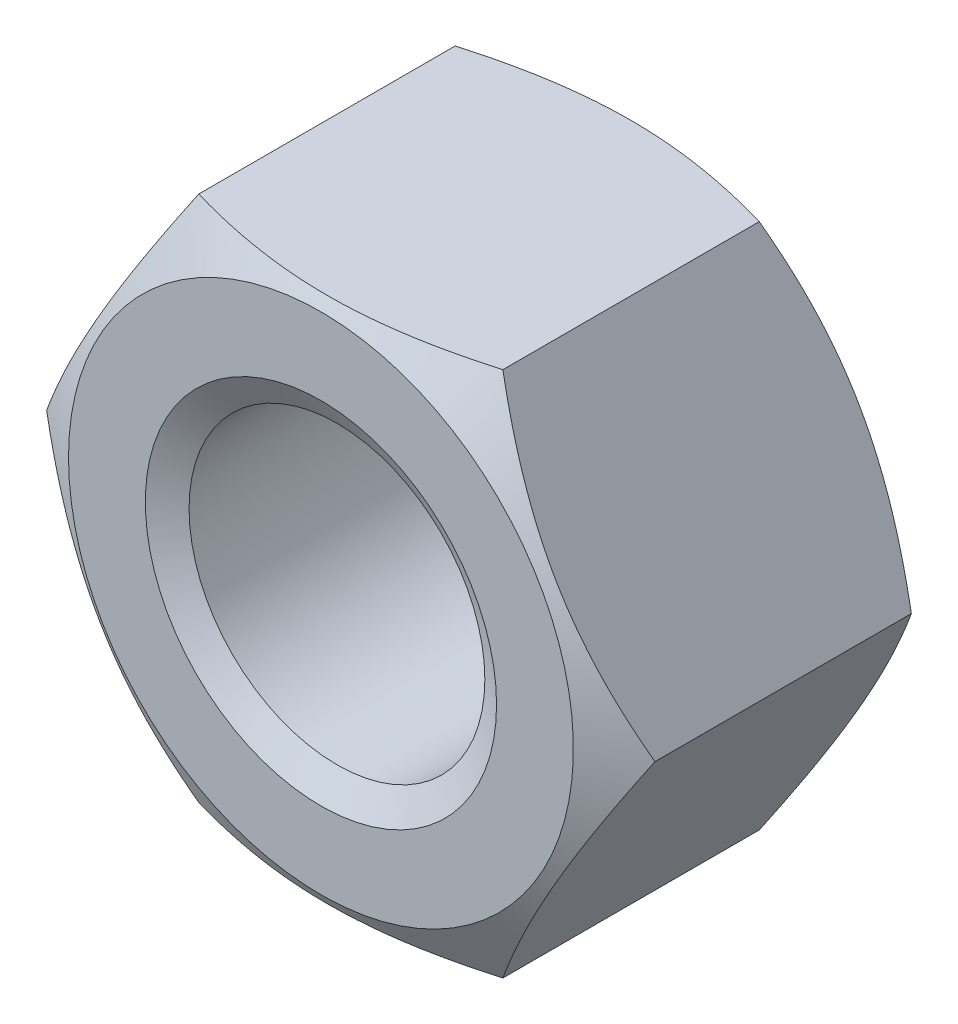
ISO-10303-21;
HEADER;
FILE_DESCRIPTION(('STEP AP214'),'2;1');
FILE_NAME('part.step','',(''),(''),'','','');
FILE_SCHEMA(('AUTOMOTIVE_DESIGN { 1 0 10303 214 1 1 1 1 }'));
ENDSEC;
DATA;
#1=APPLICATION_CONTEXT('core data for automotive mechanical design processes');
#2=APPLICATION_PROTOCOL_DEFINITION('international standard','automotive_design',2000,#1);
#3=PRODUCT_CONTEXT('',#1,'mechanical');
#4=PRODUCT('Part','Part','',(#3));
#5=PRODUCT_RELATED_PRODUCT_CATEGORY('part','',(#4));
#6=PRODUCT_DEFINITION_FORMATION('','',#4);
#7=PRODUCT_DEFINITION_CONTEXT('part definition',#1,'design');
#8=PRODUCT_DEFINITION('design','',#6,#7);
#9=PRODUCT_DEFINITION_SHAPE('','',#8);
#10=(LENGTH_UNIT() NAMED_UNIT(*) SI_UNIT(.MILLI.,.METRE.));
#11=(NAMED_UNIT(*) PLANE_ANGLE_UNIT() SI_UNIT($,.RADIAN.));
#12=(NAMED_UNIT(*) SI_UNIT($,.STERADIAN.) SOLID_ANGLE_UNIT());
#13=UNCERTAINTY_MEASURE_WITH_UNIT(LENGTH_MEASURE(1.E-05),#10,'distance_accuracy_value','');
#14=(GEOMETRIC_REPRESENTATION_CONTEXT(3) GLOBAL_UNCERTAINTY_ASSIGNED_CONTEXT((#13)) GLOBAL_UNIT_ASSIGNED_CONTEXT((#10,
#11,#12)) REPRESENTATION_CONTEXT('',''));
#15=CARTESIAN_POINT('',(0.,0.,0.));
#16=DIRECTION('',(0.,0.,1.));
#17=DIRECTION('',(1.,0.,0.));
#18=AXIS2_PLACEMENT_3D('',#15,#16,#17);
#19=CARTESIAN_POINT('',(5.19615242270663,-9.,-10.8));
#20=DIRECTION('',(0.866025403784439,-0.5,0.));
#21=DIRECTION('',(0.5,0.866025403784439,0.));
#22=AXIS2_PLACEMENT_3D('',#19,#20,#21);
#23=PLANE('',#22);
#24=CARTESIAN_POINT('',(5.19603695265279,-9.0002,-1.02042059601723));
#25=CARTESIAN_POINT('',(5.31024090414014,-8.80239295359878,-0.954488352820151));
#26=CARTESIAN_POINT('',(5.42489028935503,-8.60381439335005,-0.891547760156409));
#27=CARTESIAN_POINT('',(5.65512011728599,-8.20504463395579,-0.772475348601635));
#28=CARTESIAN_POINT('',(5.77070093910682,-8.00485277818155,-0.716346468698161));
#29=CARTESIAN_POINT('',(6.00300811711762,-7.6024849429039,-0.611658311675062));
#30=CARTESIAN_POINT('',(6.11973652630804,-7.4003054074994,-0.563117123858886));
#31=CARTESIAN_POINT('',(6.35398725476077,-6.99457124410925,-0.474654867734021));
#32=CARTESIAN_POINT('',(6.47150940676616,-6.79101690582109,-0.434732038429374));
#33=CARTESIAN_POINT('',(6.70436794207328,-6.38769409169309,-0.365191025093216));
#34=CARTESIAN_POINT('',(6.81968712510143,-6.187955407601,-0.335343853793902));
#35=CARTESIAN_POINT('',(7.05084147798785,-5.787584324011,-0.285299660805185));
#36=CARTESIAN_POINT('',(7.16667660134328,-5.58695200505839,-0.265101786483643));
#37=CARTESIAN_POINT('',(7.39854776775318,-5.18533936402618,-0.23486069834345));
#38=CARTESIAN_POINT('',(7.51458343241836,-4.98435969733606,-0.224805960530406));
#39=CARTESIAN_POINT('',(7.74676155069016,-4.58221540008358,-0.215068686091186));
#40=CARTESIAN_POINT('',(7.86290400088661,-4.38105077542778,-0.215385829010859));
#41=CARTESIAN_POINT('',(8.08003584616207,-4.0049673874695,-0.225670303099276));
#42=CARTESIAN_POINT('',(8.18104055171996,-3.83002210563971,-0.234383090976499));
#43=CARTESIAN_POINT('',(8.38281337570171,-3.48054132291665,-0.259483691011472));
#44=CARTESIAN_POINT('',(8.4835814777175,-3.30600585044303,-0.275872020526772));
#45=CARTESIAN_POINT('',(8.78549567413909,-2.7830751227145,-0.336162907181933));
#46=CARTESIAN_POINT('',(8.98610736306935,-2.43560548489508,-0.391183833287231));
#47=CARTESIAN_POINT('',(9.38945876049729,-1.736980371246,-0.528736827271252));
#48=CARTESIAN_POINT('',(9.59214699192736,-1.38591405631283,-0.611851969573208));
#49=CARTESIAN_POINT('',(9.99450087051226,-0.689016695981394,-0.800488890382561));
#50=CARTESIAN_POINT('',(10.1941716700214,-0.34317672644372,-0.905966363839456));
#51=CARTESIAN_POINT('',(10.3924203154671,0.000200000000002153,-1.02042059601723));
#52=B_SPLINE_CURVE_WITH_KNOTS('',3,(#24,#25,#26,#27,#28,#29,#30,#31,#32,#33,#34,#35,#36,#37,#38,
#39,#40,#41,#42,#43,#44,#45,#46,#47,#48,#49,#50,#51),.UNSPECIFIED.,.F.,.F.,(4,2,2,2,2,2,2,2,2,2,
2,2,2,4),(0.,0.713219249102577,1.42674513853509,2.14194697262263,2.8570025303448,
3.55449749123034,4.25193080859214,4.94857085059645,5.64518936892662,6.25162976378283,
6.8581110406634,8.07193747617894,9.31268391793541,10.5509947443908),.UNSPECIFIED.);
#53=CARTESIAN_POINT('',(5.19615242270663,-9.,-1.02035392823946));
#54=VERTEX_POINT('',#53);
#55=CARTESIAN_POINT('',(10.3923048454133,0.,-1.02035392823947));
#56=VERTEX_POINT('',#55);
#57=EDGE_CURVE('E51',#54,#56,#52,.T.);
#58=ORIENTED_EDGE('',*,*,#57,.F.);
#59=DIRECTION('',(0.,0.,1.));
#60=VECTOR('',#59,1.);
#61=CARTESIAN_POINT('',(5.19615242270663,-9.,-10.8));
#62=LINE('',#61,#60);
#63=CARTESIAN_POINT('',(5.19615242270663,-9.,-9.77964607176054));
#64=VERTEX_POINT('',#63);
#65=EDGE_CURVE('E115',#64,#54,#62,.T.);
#66=ORIENTED_EDGE('',*,*,#65,.F.);
#67=CARTESIAN_POINT('',(10.3924203154671,0.000200000000001869,-9.77957940398277));
#68=CARTESIAN_POINT('',(10.2782163639798,-0.197607046401214,-9.84551164717985));
#69=CARTESIAN_POINT('',(10.1635669787649,-0.396185606649942,-9.90845223984359));
#70=CARTESIAN_POINT('',(9.9333371508339,-0.794955366044206,-10.0275246513984));
#71=CARTESIAN_POINT('',(9.81775632901307,-0.995147221818447,-10.0836535313018));
#72=CARTESIAN_POINT('',(9.58544915100228,-1.39751505709609,-10.1883416883249));
#73=CARTESIAN_POINT('',(9.46872074181185,-1.59969459250059,-10.2368828761411));
#74=CARTESIAN_POINT('',(9.23447001335912,-2.00542875589074,-10.325345132266));
#75=CARTESIAN_POINT('',(9.11694786135374,-2.20898309417891,-10.3652679615706));
#76=CARTESIAN_POINT('',(8.88408932604662,-2.61230590830691,-10.4348089749068));
#77=CARTESIAN_POINT('',(8.76877014301847,-2.812044592399,-10.4646561462061));
#78=CARTESIAN_POINT('',(8.53761579013204,-3.21241567598899,-10.5147003391948));
#79=CARTESIAN_POINT('',(8.42178066677661,-3.4130479949416,-10.5348982135164));
#80=CARTESIAN_POINT('',(8.18990950036671,-3.81466063597381,-10.5651393016566));
#81=CARTESIAN_POINT('',(8.07387383570153,-4.01564030266393,-10.5751940394696));
#82=CARTESIAN_POINT('',(7.84169571742973,-4.41778459991642,-10.5849313139088));
#83=CARTESIAN_POINT('',(7.72555326723328,-4.61894922457222,-10.5846141709891));
#84=CARTESIAN_POINT('',(7.50842142195782,-4.9950326125305,-10.5743296969007));
#85=CARTESIAN_POINT('',(7.40741671639994,-5.16997789436028,-10.5656169090235));
#86=CARTESIAN_POINT('',(7.20564389241818,-5.51945867708334,-10.5405163089885));
#87=CARTESIAN_POINT('',(7.10487579040239,-5.69399414955696,-10.5241279794732));
#88=CARTESIAN_POINT('',(6.8029615939808,-6.2169248772855,-10.4638370928181));
#89=CARTESIAN_POINT('',(6.60234990505054,-6.56439451510491,-10.4088161667128));
#90=CARTESIAN_POINT('',(6.19899850762261,-7.263019628754,-10.2712631727288));
#91=CARTESIAN_POINT('',(5.99631027619253,-7.61408594368717,-10.1881480304268));
#92=CARTESIAN_POINT('',(5.59395639760764,-8.3109833040186,-9.99951110961744));
#93=CARTESIAN_POINT('',(5.39428559809853,-8.65682327355628,-9.89403363616055));
#94=CARTESIAN_POINT('',(5.19603695265279,-9.0002,-9.77957940398277));
#95=B_SPLINE_CURVE_WITH_KNOTS('',3,(#67,#68,#69,#70,#71,#72,#73,#74,#75,#76,#77,#78,#79,#80,#81,
#82,#83,#84,#85,#86,#87,#88,#89,#90,#91,#92,#93,#94),.UNSPECIFIED.,.F.,.F.,(4,2,2,2,2,2,2,2,2,2,
2,2,2,4),(0.,0.713219249102576,1.42674513853509,2.14194697262263,2.8570025303448,
3.55449749123034,4.25193080859214,4.94857085059645,5.64518936892662,6.25162976378283,
6.8581110406634,8.07193747617893,9.31268391793541,10.5509947443908),.UNSPECIFIED.);
#96=CARTESIAN_POINT('',(10.3923048454133,0.,-9.77964607176054));
#97=VERTEX_POINT('',#96);
#98=EDGE_CURVE('E126',#97,#64,#95,.T.);
#99=ORIENTED_EDGE('',*,*,#98,.F.);
#100=DIRECTION('',(0.,0.,1.));
#101=VECTOR('',#100,1.);
#102=CARTESIAN_POINT('',(10.3923048454133,0.,-10.8));
#103=LINE('',#102,#101);
#104=EDGE_CURVE('E123',#97,#56,#103,.T.);
#105=ORIENTED_EDGE('',*,*,#104,.T.);
#106=EDGE_LOOP('',(#58,#66,#99,#105));
#107=FACE_BOUND('',#106,.T.);
#108=ADVANCED_FACE('F36',(#107),#23,.T.);
#109=CARTESIAN_POINT('',(-5.19615242270663,-9.,-10.8));
#110=DIRECTION('',(0.,-1.,0.));
#111=DIRECTION('',(1.,0.,0.));
#112=AXIS2_PLACEMENT_3D('',#109,#110,#111);
#113=PLANE('',#112);
#114=CARTESIAN_POINT('',(-13.7509549197459,-9.,-4.50874615602465));
#115=CARTESIAN_POINT('',(-13.5535031756334,-9.,-4.4133632005304));
#116=CARTESIAN_POINT('',(-13.3558119121055,-9.,-4.31847631202291));
#117=CARTESIAN_POINT('',(-12.9598997423527,-9.,-4.129808606453));
#118=CARTESIAN_POINT('',(-12.7616788302979,-9.,-4.03602780162757));
#119=CARTESIAN_POINT('',(-12.1660871756627,-9.,-3.75648801981495));
#120=CARTESIAN_POINT('',(-11.7678522296242,-9.,-3.57256302818573));
#121=CARTESIAN_POINT('',(-10.9663259257918,-9.,-3.20973828220075));
#122=CARTESIAN_POINT('',(-10.5630186543586,-9.,-3.03087359353563));
#123=CARTESIAN_POINT('',(-9.75307886606775,-9.,-2.68086718415945));
#124=CARTESIAN_POINT('',(-9.34644652483285,-9.,-2.50972505863256));
#125=CARTESIAN_POINT('',(-8.52430065928809,-9.,-2.1752489322366));
#126=CARTESIAN_POINT('',(-8.10873905726062,-9.,-2.01203245295186));
#127=CARTESIAN_POINT('',(-7.27270479696096,-9.,-1.69845734556386));
#128=CARTESIAN_POINT('',(-6.85223159735817,-9.,-1.54810015023457));
#129=CARTESIAN_POINT('',(-6.00657361558289,-9.,-1.26430650766903));
#130=CARTESIAN_POINT('',(-5.58140112925816,-9.,-1.13083382231665));
#131=CARTESIAN_POINT('',(-4.72502847565832,-9.,-0.885160964193325));
#132=CARTESIAN_POINT('',(-4.29383026814136,-9.,-0.772954040393669));
#133=CARTESIAN_POINT('',(-3.42502754389001,-9.,-0.575284730921593));
#134=CARTESIAN_POINT('',(-2.98742098844678,-9.,-0.489831058722944));
#135=CARTESIAN_POINT('',(-2.32718643171478,-9.,-0.386011510591226));
#136=CARTESIAN_POINT('',(-2.10644379374574,-9.,-0.355462928041222));
#137=CARTESIAN_POINT('',(-1.66393320633416,-9.,-0.303087501431236));
#138=CARTESIAN_POINT('',(-1.44216535588337,-9.,-0.281259832389955));
#139=CARTESIAN_POINT('',(-0.999294640958746,-9.,-0.246912367474811));
#140=CARTESIAN_POINT('',(-0.778196218208704,-9.,-0.234335529337242));
#141=CARTESIAN_POINT('',(-0.33566581664177,-9.,-0.218555713805037));
#142=CARTESIAN_POINT('',(-0.114233842880021,-9.,-0.215352595748731));
#143=CARTESIAN_POINT('',(0.328504378694801,-9.,-0.218396391793385));
#144=CARTESIAN_POINT('',(0.549810644346882,-9.,-0.22464067778229));
#145=CARTESIAN_POINT('',(0.991968287718334,-9.,-0.246424831117821));
#146=CARTESIAN_POINT('',(1.21281964031524,-9.,-0.261965198722206));
#147=CARTESIAN_POINT('',(1.74889913865843,-9.,-0.310646617639724));
#148=CARTESIAN_POINT('',(2.0637085188756,-9.,-0.348489804625184));
#149=CARTESIAN_POINT('',(2.69084086945109,-9.,-0.440950377931198));
#150=CARTESIAN_POINT('',(3.00316345985697,-9.,-0.495570278931053));
#151=CARTESIAN_POINT('',(3.93695589322469,-9.,-0.681853392022292));
#152=CARTESIAN_POINT('',(4.55402787057383,-9.,-0.835814916571926));
#153=CARTESIAN_POINT('',(5.47700556518123,-9.,-1.10103782162777));
#154=CARTESIAN_POINT('',(5.78774000467541,-9.,-1.19644657916086));
#155=CARTESIAN_POINT('',(6.40620708122238,-9.,-1.3967158252731));
#156=CARTESIAN_POINT('',(6.71393944593979,-9.,-1.50157716267441));
#157=CARTESIAN_POINT('',(7.32486593012849,-9.,-1.71850923148447));
#158=CARTESIAN_POINT('',(7.62807586983131,-9.,-1.83053586074419));
#159=CARTESIAN_POINT('',(8.23191944766464,-9.,-2.06103780630502));
#160=CARTESIAN_POINT('',(8.53255393983556,-9.,-2.17951088087441));
#161=CARTESIAN_POINT('',(8.83210470319612,-9.,-2.30060285915335));
#162=B_SPLINE_CURVE_WITH_KNOTS('',3,(#114,#115,#116,#117,#118,#119,#120,#121,#122,#123,#124,
#125,#126,#127,#128,#129,#130,#131,#132,#133,#134,#135,#136,#137,#138,#139,#140,#141,#142,#143,
#144,#145,#146,#147,#148,#149,#150,#151,#152,#153,#154,#155,#156,#157,#158,#159,#160,#161),
.UNSPECIFIED.,.F.,.F.,(4,2,2,2,2,2,2,2,2,2,2,2,2,2,2,2,2,2,2,2,2,2,2,4),(0.,0.657848161299417,
1.31570359379443,2.63163017509698,3.95513983357958,5.27858003305641,6.61781030656202,
7.95718960245973,9.29364366231274,10.6296727381635,11.9661365040715,12.6345305008377,
13.3028612538646,13.9670355982855,14.6311999760814,15.2951796282648,15.9591950149513,
16.9098816261576,17.8607108063766,19.766039523808,20.7411201920658,21.7162885079468,
22.6859446093727,23.6552656444379),.UNSPECIFIED.);
#163=CARTESIAN_POINT('',(-5.19615242270662,-9.00000000000001,-1.02035392823946));
#164=VERTEX_POINT('',#163);
#165=EDGE_CURVE('E108',#164,#54,#162,.T.);
#166=ORIENTED_EDGE('',*,*,#165,.F.);
#167=DIRECTION('',(0.,0.,1.));
#168=VECTOR('',#167,1.);
#169=CARTESIAN_POINT('',(-5.19615242270663,-9.,-10.8));
#170=LINE('',#169,#168);
#171=CARTESIAN_POINT('',(-5.19615242270663,-9.00000000000001,-9.77964607176054));
#172=VERTEX_POINT('',#171);
#173=EDGE_CURVE('E107',#172,#164,#170,.T.);
#174=ORIENTED_EDGE('',*,*,#173,.F.);
#175=CARTESIAN_POINT('',(-13.7509549197459,-9.,-6.29125384397536));
#176=CARTESIAN_POINT('',(-13.5535031756335,-9.,-6.3866367994696));
#177=CARTESIAN_POINT('',(-13.3558119121055,-9.,-6.48152368797709));
#178=CARTESIAN_POINT('',(-12.9598997423527,-9.,-6.67019139354701));
#179=CARTESIAN_POINT('',(-12.7616788302979,-9.,-6.76397219837243));
#180=CARTESIAN_POINT('',(-12.1660871756627,-9.,-7.04351198018505));
#181=CARTESIAN_POINT('',(-11.7678522296242,-9.,-7.22743697181427));
#182=CARTESIAN_POINT('',(-10.9663259257918,-9.,-7.59026171779925));
#183=CARTESIAN_POINT('',(-10.5630186543586,-9.,-7.76912640646438));
#184=CARTESIAN_POINT('',(-9.75307886606775,-9.,-8.11913281584055));
#185=CARTESIAN_POINT('',(-9.34644652483285,-9.,-8.29027494136744));
#186=CARTESIAN_POINT('',(-8.52430065928809,-9.,-8.6247510677634));
#187=CARTESIAN_POINT('',(-8.10873905726062,-9.,-8.78796754704814));
#188=CARTESIAN_POINT('',(-7.27270479696096,-9.,-9.10154265443614));
#189=CARTESIAN_POINT('',(-6.85223159735817,-9.,-9.25189984976544));
#190=CARTESIAN_POINT('',(-6.0065736155829,-9.,-9.53569349233097));
#191=CARTESIAN_POINT('',(-5.58140112925816,-9.,-9.66916617768336));
#192=CARTESIAN_POINT('',(-4.72502847565832,-9.,-9.91483903580668));
#193=CARTESIAN_POINT('',(-4.29383026814137,-9.,-10.0270459596063));
#194=CARTESIAN_POINT('',(-3.42502754389002,-9.,-10.2247152690784));
#195=CARTESIAN_POINT('',(-2.98742098844678,-9.,-10.3101689412771));
#196=CARTESIAN_POINT('',(-2.32718643171478,-9.,-10.4139884894088));
#197=CARTESIAN_POINT('',(-2.10644379374574,-9.,-10.4445370719588));
#198=CARTESIAN_POINT('',(-1.66393320633416,-9.,-10.4969124985688));
#199=CARTESIAN_POINT('',(-1.44216535588337,-9.,-10.51874016761));
#200=CARTESIAN_POINT('',(-0.999294640958746,-9.,-10.5530876325252));
#201=CARTESIAN_POINT('',(-0.778196218208704,-9.,-10.5656644706628));
#202=CARTESIAN_POINT('',(-0.335665816641771,-9.,-10.581444286195));
#203=CARTESIAN_POINT('',(-0.114233842880021,-9.,-10.5846474042513));
#204=CARTESIAN_POINT('',(0.328504378694802,-9.,-10.5816036082066));
#205=CARTESIAN_POINT('',(0.549810644346882,-9.,-10.5753593222177));
#206=CARTESIAN_POINT('',(0.991968287718335,-9.,-10.5535751688822));
#207=CARTESIAN_POINT('',(1.21281964031524,-9.,-10.5380348012778));
#208=CARTESIAN_POINT('',(1.74889913865843,-9.,-10.4893533823603));
#209=CARTESIAN_POINT('',(2.0637085188756,-9.,-10.4515101953748));
#210=CARTESIAN_POINT('',(2.69084086945109,-9.,-10.3590496220688));
#211=CARTESIAN_POINT('',(3.00316345985697,-9.,-10.3044297210689));
#212=CARTESIAN_POINT('',(3.93695589322469,-9.,-10.1181466079777));
#213=CARTESIAN_POINT('',(4.55402787057383,-9.,-9.96418508342808));
#214=CARTESIAN_POINT('',(5.47700556518123,-9.,-9.69896217837224));
#215=CARTESIAN_POINT('',(5.78774000467541,-9.,-9.60355342083914));
#216=CARTESIAN_POINT('',(6.40620708122238,-9.,-9.4032841747269));
#217=CARTESIAN_POINT('',(6.71393944593979,-9.,-9.29842283732559));
#218=CARTESIAN_POINT('',(7.32486593012849,-9.,-9.08149076851553));
#219=CARTESIAN_POINT('',(7.62807586983131,-9.,-8.96946413925581));
#220=CARTESIAN_POINT('',(8.23191944766464,-9.,-8.73896219369498));
#221=CARTESIAN_POINT('',(8.53255393983557,-9.,-8.62048911912559));
#222=CARTESIAN_POINT('',(8.83210470319612,-9.,-8.49939714084665));
#223=B_SPLINE_CURVE_WITH_KNOTS('',3,(#175,#176,#177,#178,#179,#180,#181,#182,#183,#184,#185,
#186,#187,#188,#189,#190,#191,#192,#193,#194,#195,#196,#197,#198,#199,#200,#201,#202,#203,#204,
#205,#206,#207,#208,#209,#210,#211,#212,#213,#214,#215,#216,#217,#218,#219,#220,#221,#222),
.UNSPECIFIED.,.F.,.F.,(4,2,2,2,2,2,2,2,2,2,2,2,2,2,2,2,2,2,2,2,2,2,2,4),(0.,0.657848161299414,
1.31570359379443,2.63163017509698,3.95513983357958,5.27858003305641,6.61781030656202,
7.95718960245973,9.29364366231274,10.6296727381635,11.9661365040715,12.6345305008377,
13.3028612538646,13.9670355982855,14.6311999760814,15.2951796282648,15.9591950149513,
16.9098816261576,17.8607108063766,19.766039523808,20.7411201920658,21.7162885079468,
22.6859446093727,23.6552656444379),.UNSPECIFIED.);
#224=EDGE_CURVE('E197',#64,#172,#223,.F.);
#225=ORIENTED_EDGE('',*,*,#224,.F.);
#226=ORIENTED_EDGE('',*,*,#65,.T.);
#227=EDGE_LOOP('',(#166,#174,#225,#226));
#228=FACE_BOUND('',#227,.T.);
#229=ADVANCED_FACE('F205',(#228),#113,.T.);
#230=CARTESIAN_POINT('',(-10.3923048454133,0.,-10.8));
#231=DIRECTION('',(-0.866025403784438,-0.5,0.));
#232=DIRECTION('',(0.5,-0.866025403784439,0.));
#233=AXIS2_PLACEMENT_3D('',#230,#231,#232);
#234=PLANE('',#233);
#235=CARTESIAN_POINT('',(-10.3924203154671,0.000200000000003528,-1.02042059601723));
#236=CARTESIAN_POINT('',(-10.2782163639798,-0.197607046401213,-0.954488352820152));
#237=CARTESIAN_POINT('',(-10.1635669787649,-0.396185606649941,-0.89154776015641));
#238=CARTESIAN_POINT('',(-9.9333371508339,-0.794955366044205,-0.772475348601635));
#239=CARTESIAN_POINT('',(-9.81775632901307,-0.995147221818446,-0.716346468698162));
#240=CARTESIAN_POINT('',(-9.58544915100228,-1.39751505709609,-0.611658311675063));
#241=CARTESIAN_POINT('',(-9.46872074181186,-1.59969459250059,-0.563117123858887));
#242=CARTESIAN_POINT('',(-9.23447001335913,-2.00542875589074,-0.474654867734021));
#243=CARTESIAN_POINT('',(-9.11694786135374,-2.2089830941789,-0.434732038429375));
#244=CARTESIAN_POINT('',(-8.88408932604662,-2.61230590830691,-0.365191025093216));
#245=CARTESIAN_POINT('',(-8.76877014301847,-2.812044592399,-0.335343853793901));
#246=CARTESIAN_POINT('',(-8.53761579013204,-3.21241567598899,-0.285299660805184));
#247=CARTESIAN_POINT('',(-8.42178066677661,-3.4130479949416,-0.265101786483643));
#248=CARTESIAN_POINT('',(-8.18990950036671,-3.81466063597381,-0.234860698343451));
#249=CARTESIAN_POINT('',(-8.07387383570153,-4.01564030266393,-0.224805960530406));
#250=CARTESIAN_POINT('',(-7.84169571742973,-4.41778459991642,-0.215068686091185));
#251=CARTESIAN_POINT('',(-7.72555326723328,-4.61894922457221,-0.215385829010859));
#252=CARTESIAN_POINT('',(-7.50842142195782,-4.99503261253049,-0.225670303099276));
#253=CARTESIAN_POINT('',(-7.40741671639994,-5.16997789436028,-0.234383090976499));
#254=CARTESIAN_POINT('',(-7.20564389241818,-5.51945867708334,-0.259483691011472));
#255=CARTESIAN_POINT('',(-7.10487579040239,-5.69399414955696,-0.275872020526771));
#256=CARTESIAN_POINT('',(-6.8029615939808,-6.2169248772855,-0.336162907181931));
#257=CARTESIAN_POINT('',(-6.60234990505054,-6.56439451510491,-0.391183833287229));
#258=CARTESIAN_POINT('',(-6.1989985076226,-7.263019628754,-0.528736827271251));
#259=CARTESIAN_POINT('',(-5.99631027619253,-7.61408594368717,-0.611851969573207));
#260=CARTESIAN_POINT('',(-5.59395639760763,-8.3109833040186,-0.800488890382561));
#261=CARTESIAN_POINT('',(-5.39428559809853,-8.65682327355628,-0.905966363839455));
#262=CARTESIAN_POINT('',(-5.19603695265279,-9.0002,-1.02042059601723));
#263=B_SPLINE_CURVE_WITH_KNOTS('',3,(#235,#236,#237,#238,#239,#240,#241,#242,#243,#244,#245,
#246,#247,#248,#249,#250,#251,#252,#253,#254,#255,#256,#257,#258,#259,#260,#261,#262),
.UNSPECIFIED.,.F.,.F.,(4,2,2,2,2,2,2,2,2,2,2,2,2,4),(0.,0.713219249102577,1.42674513853509,
2.14194697262263,2.8570025303448,3.55449749123034,4.25193080859214,4.94857085059645,
5.64518936892662,6.25162976378283,6.8581110406634,8.07193747617894,9.31268391793541,
10.5509947443908),.UNSPECIFIED.);
#264=CARTESIAN_POINT('',(-10.3923048454133,0.,-1.02035392823946));
#265=VERTEX_POINT('',#264);
#266=EDGE_CURVE('E91',#265,#164,#263,.T.);
#267=ORIENTED_EDGE('',*,*,#266,.F.);
#268=DIRECTION('',(0.,0.,1.));
#269=VECTOR('',#268,1.);
#270=CARTESIAN_POINT('',(-10.3923048454133,0.,-10.8));
#271=LINE('',#270,#269);
#272=CARTESIAN_POINT('',(-10.3923048454133,0.,-9.77964607176054));
#273=VERTEX_POINT('',#272);
#274=EDGE_CURVE('E105',#273,#265,#271,.T.);
#275=ORIENTED_EDGE('',*,*,#274,.F.);
#276=CARTESIAN_POINT('',(-5.19603695265279,-9.0002,-9.77957940398277));
#277=CARTESIAN_POINT('',(-5.31024090414014,-8.80239295359879,-9.84551164717985));
#278=CARTESIAN_POINT('',(-5.42489028935503,-8.60381439335005,-9.90845223984359));
#279=CARTESIAN_POINT('',(-5.65512011728599,-8.20504463395579,-10.0275246513984));
#280=CARTESIAN_POINT('',(-5.77070093910682,-8.00485277818155,-10.0836535313018));
#281=CARTESIAN_POINT('',(-6.00300811711761,-7.6024849429039,-10.1883416883249));
#282=CARTESIAN_POINT('',(-6.11973652630804,-7.4003054074994,-10.2368828761411));
#283=CARTESIAN_POINT('',(-6.35398725476077,-6.99457124410926,-10.325345132266));
#284=CARTESIAN_POINT('',(-6.47150940676615,-6.79101690582109,-10.3652679615706));
#285=CARTESIAN_POINT('',(-6.70436794207327,-6.38769409169309,-10.4348089749068));
#286=CARTESIAN_POINT('',(-6.81968712510142,-6.187955407601,-10.4646561462061));
#287=CARTESIAN_POINT('',(-7.05084147798785,-5.78758432401101,-10.5147003391948));
#288=CARTESIAN_POINT('',(-7.16667660134327,-5.5869520050584,-10.5348982135164));
#289=CARTESIAN_POINT('',(-7.39854776775318,-5.18533936402619,-10.5651393016566));
#290=CARTESIAN_POINT('',(-7.51458343241836,-4.98435969733607,-10.5751940394696));
#291=CARTESIAN_POINT('',(-7.74676155069016,-4.58221540008358,-10.5849313139088));
#292=CARTESIAN_POINT('',(-7.86290400088661,-4.38105077542778,-10.5846141709891));
#293=CARTESIAN_POINT('',(-8.08003584616207,-4.0049673874695,-10.5743296969007));
#294=CARTESIAN_POINT('',(-8.18104055171995,-3.83002210563971,-10.5656169090235));
#295=CARTESIAN_POINT('',(-8.38281337570171,-3.48054132291666,-10.5405163089885));
#296=CARTESIAN_POINT('',(-8.4835814777175,-3.30600585044303,-10.5241279794732));
#297=CARTESIAN_POINT('',(-8.7854956741391,-2.7830751227145,-10.4638370928181));
#298=CARTESIAN_POINT('',(-8.98610736306935,-2.43560548489509,-10.4088161667128));
#299=CARTESIAN_POINT('',(-9.38945876049729,-1.736980371246,-10.2712631727288));
#300=CARTESIAN_POINT('',(-9.59214699192736,-1.38591405631283,-10.1881480304268));
#301=CARTESIAN_POINT('',(-9.99450087051226,-0.689016695981392,-9.99951110961744));
#302=CARTESIAN_POINT('',(-10.1941716700214,-0.343176726443718,-9.89403363616055));
#303=CARTESIAN_POINT('',(-10.3924203154671,0.000200000000002708,-9.77957940398277));
#304=B_SPLINE_CURVE_WITH_KNOTS('',3,(#276,#277,#278,#279,#280,#281,#282,#283,#284,#285,#286,
#287,#288,#289,#290,#291,#292,#293,#294,#295,#296,#297,#298,#299,#300,#301,#302,#303),
.UNSPECIFIED.,.F.,.F.,(4,2,2,2,2,2,2,2,2,2,2,2,2,4),(0.,0.713219249102577,1.42674513853509,
2.14194697262263,2.8570025303448,3.55449749123033,4.25193080859214,4.94857085059645,
5.64518936892662,6.25162976378283,6.8581110406634,8.07193747617894,9.31268391793542,
10.5509947443908),.UNSPECIFIED.);
#305=EDGE_CURVE('E191',#172,#273,#304,.T.);
#306=ORIENTED_EDGE('',*,*,#305,.F.);
#307=ORIENTED_EDGE('',*,*,#173,.T.);
#308=EDGE_LOOP('',(#267,#275,#306,#307));
#309=FACE_BOUND('',#308,.T.);
#310=ADVANCED_FACE('F103',(#309),#234,.T.);
#311=CARTESIAN_POINT('',(-5.19615242270663,9.,-10.8));
#312=DIRECTION('',(-0.866025403784439,0.5,0.));
#313=DIRECTION('',(-0.5,-0.866025403784438,0.));
#314=AXIS2_PLACEMENT_3D('',#311,#312,#313);
#315=PLANE('',#314);
#316=CARTESIAN_POINT('',(-5.19603695265279,9.0002,-1.02042059601723));
#317=CARTESIAN_POINT('',(-5.31024090414014,8.80239295359878,-0.954488352820151));
#318=CARTESIAN_POINT('',(-5.42489028935503,8.60381439335005,-0.89154776015641));
#319=CARTESIAN_POINT('',(-5.65512011728599,8.20504463395579,-0.772475348601636));
#320=CARTESIAN_POINT('',(-5.77070093910682,8.00485277818155,-0.716346468698163));
#321=CARTESIAN_POINT('',(-6.00300811711762,7.6024849429039,-0.611658311675063));
#322=CARTESIAN_POINT('',(-6.11973652630804,7.4003054074994,-0.563117123858886));
#323=CARTESIAN_POINT('',(-6.35398725476077,6.99457124410925,-0.474654867734021));
#324=CARTESIAN_POINT('',(-6.47150940676616,6.79101690582109,-0.434732038429375));
#325=CARTESIAN_POINT('',(-6.70436794207328,6.38769409169308,-0.365191025093217));
#326=CARTESIAN_POINT('',(-6.81968712510143,6.187955407601,-0.335343853793903));
#327=CARTESIAN_POINT('',(-7.05084147798785,5.78758432401101,-0.285299660805186));
#328=CARTESIAN_POINT('',(-7.16667660134328,5.5869520050584,-0.265101786483644));
#329=CARTESIAN_POINT('',(-7.39854776775318,5.18533936402618,-0.234860698343451));
#330=CARTESIAN_POINT('',(-7.51458343241837,4.98435969733607,-0.224805960530408));
#331=CARTESIAN_POINT('',(-7.74676155069016,4.58221540008358,-0.215068686091187));
#332=CARTESIAN_POINT('',(-7.86290400088662,4.38105077542778,-0.215385829010861));
#333=CARTESIAN_POINT('',(-8.08003584616208,4.0049673874695,-0.225670303099277));
#334=CARTESIAN_POINT('',(-8.18104055171996,3.83002210563971,-0.234383090976501));
#335=CARTESIAN_POINT('',(-8.38281337570172,3.48054132291665,-0.259483691011474));
#336=CARTESIAN_POINT('',(-8.4835814777175,3.30600585044303,-0.275872020526774));
#337=CARTESIAN_POINT('',(-8.7854956741391,2.7830751227145,-0.336162907181935));
#338=CARTESIAN_POINT('',(-8.98610736306936,2.43560548489509,-0.391183833287233));
#339=CARTESIAN_POINT('',(-9.38945876049729,1.736980371246,-0.528736827271253));
#340=CARTESIAN_POINT('',(-9.59214699192736,1.38591405631283,-0.611851969573208));
#341=CARTESIAN_POINT('',(-9.99450087051226,0.6890166959814,-0.800488890382561));
#342=CARTESIAN_POINT('',(-10.1941716700214,0.343176726443727,-0.905966363839455));
#343=CARTESIAN_POINT('',(-10.3924203154671,-0.000199999999995087,-1.02042059601723));
#344=B_SPLINE_CURVE_WITH_KNOTS('',3,(#316,#317,#318,#319,#320,#321,#322,#323,#324,#325,#326,
#327,#328,#329,#330,#331,#332,#333,#334,#335,#336,#337,#338,#339,#340,#341,#342,#343),
.UNSPECIFIED.,.F.,.F.,(4,2,2,2,2,2,2,2,2,2,2,2,2,4),(0.,0.713219249102577,1.42674513853509,
2.14194697262263,2.8570025303448,3.55449749123034,4.25193080859214,4.94857085059645,
5.64518936892662,6.25162976378283,6.8581110406634,8.07193747617893,9.31268391793541,
10.5509947443908),.UNSPECIFIED.);
#345=CARTESIAN_POINT('',(-5.19615242270664,9.,-1.02035392823946));
#346=VERTEX_POINT('',#345);
#347=EDGE_CURVE('E87',#346,#265,#344,.T.);
#348=ORIENTED_EDGE('',*,*,#347,.F.);
#349=DIRECTION('',(0.,0.,1.));
#350=VECTOR('',#349,1.);
#351=CARTESIAN_POINT('',(-5.19615242270663,9.,-10.8));
#352=LINE('',#351,#350);
#353=CARTESIAN_POINT('',(-5.19615242270663,9.,-9.77964607176054));
#354=VERTEX_POINT('',#353);
#355=EDGE_CURVE('E113',#354,#346,#352,.T.);
#356=ORIENTED_EDGE('',*,*,#355,.F.);
#357=CARTESIAN_POINT('',(-10.3924203154671,-0.000199999999996146,-9.77957940398277));
#358=CARTESIAN_POINT('',(-10.2782163639798,0.19760704640122,-9.84551164717985));
#359=CARTESIAN_POINT('',(-10.1635669787649,0.396185606649949,-9.90845223984359));
#360=CARTESIAN_POINT('',(-9.9333371508339,0.794955366044213,-10.0275246513984));
#361=CARTESIAN_POINT('',(-9.81775632901307,0.995147221818454,-10.0836535313018));
#362=CARTESIAN_POINT('',(-9.58544915100228,1.3975150570961,-10.1883416883249));
#363=CARTESIAN_POINT('',(-9.46872074181186,1.5996945925006,-10.2368828761411));
#364=CARTESIAN_POINT('',(-9.23447001335912,2.00542875589075,-10.325345132266));
#365=CARTESIAN_POINT('',(-9.11694786135374,2.20898309417891,-10.3652679615706));
#366=CARTESIAN_POINT('',(-8.88408932604662,2.61230590830692,-10.4348089749068));
#367=CARTESIAN_POINT('',(-8.76877014301847,2.81204459239901,-10.4646561462061));
#368=CARTESIAN_POINT('',(-8.53761579013204,3.212415675989,-10.5147003391948));
#369=CARTESIAN_POINT('',(-8.42178066677661,3.41304799494161,-10.5348982135164));
#370=CARTESIAN_POINT('',(-8.18990950036671,3.81466063597382,-10.5651393016566));
#371=CARTESIAN_POINT('',(-8.07387383570153,4.01564030266394,-10.5751940394696));
#372=CARTESIAN_POINT('',(-7.84169571742973,4.41778459991642,-10.5849313139088));
#373=CARTESIAN_POINT('',(-7.72555326723328,4.61894922457222,-10.5846141709891));
#374=CARTESIAN_POINT('',(-7.50842142195782,4.9950326125305,-10.5743296969007));
#375=CARTESIAN_POINT('',(-7.40741671639994,5.16997789436029,-10.5656169090235));
#376=CARTESIAN_POINT('',(-7.20564389241818,5.51945867708335,-10.5405163089885));
#377=CARTESIAN_POINT('',(-7.10487579040239,5.69399414955697,-10.5241279794732));
#378=CARTESIAN_POINT('',(-6.8029615939808,6.2169248772855,-10.4638370928181));
#379=CARTESIAN_POINT('',(-6.60234990505054,6.56439451510491,-10.4088161667128));
#380=CARTESIAN_POINT('',(-6.19899850762261,7.263019628754,-10.2712631727287));
#381=CARTESIAN_POINT('',(-5.99631027619253,7.61408594368717,-10.1881480304268));
#382=CARTESIAN_POINT('',(-5.59395639760764,8.3109833040186,-9.99951110961744));
#383=CARTESIAN_POINT('',(-5.39428559809853,8.65682327355628,-9.89403363616055));
#384=CARTESIAN_POINT('',(-5.19603695265279,9.0002,-9.77957940398277));
#385=B_SPLINE_CURVE_WITH_KNOTS('',3,(#357,#358,#359,#360,#361,#362,#363,#364,#365,#366,#367,
#368,#369,#370,#371,#372,#373,#374,#375,#376,#377,#378,#379,#380,#381,#382,#383,#384),
.UNSPECIFIED.,.F.,.F.,(4,2,2,2,2,2,2,2,2,2,2,2,2,4),(0.,0.713219249102578,1.42674513853509,
2.14194697262263,2.8570025303448,3.55449749123034,4.25193080859214,4.94857085059645,
5.64518936892662,6.25162976378283,6.8581110406634,8.07193747617893,9.31268391793541,
10.5509947443908),.UNSPECIFIED.);
#386=EDGE_CURVE('E112',#273,#354,#385,.T.);
#387=ORIENTED_EDGE('',*,*,#386,.F.);
#388=ORIENTED_EDGE('',*,*,#274,.T.);
#389=EDGE_LOOP('',(#348,#356,#387,#388));
#390=FACE_BOUND('',#389,.T.);
#391=ADVANCED_FACE('F111',(#390),#315,.T.);
#392=CARTESIAN_POINT('',(5.19615242270663,9.,-10.8));
#393=DIRECTION('',(0.,1.,0.));
#394=DIRECTION('',(-1.,0.,0.));
#395=AXIS2_PLACEMENT_3D('',#392,#393,#394);
#396=PLANE('',#395);
#397=CARTESIAN_POINT('',(-13.7509549197459,9.,-4.50874615602465));
#398=CARTESIAN_POINT('',(-13.5535031756335,9.,-4.4133632005304));
#399=CARTESIAN_POINT('',(-13.3558119121055,9.,-4.31847631202291));
#400=CARTESIAN_POINT('',(-12.9598997423527,9.,-4.129808606453));
#401=CARTESIAN_POINT('',(-12.7616788302979,9.,-4.03602780162757));
#402=CARTESIAN_POINT('',(-12.1660871756627,9.,-3.75648801981496));
#403=CARTESIAN_POINT('',(-11.7678522296242,9.,-3.57256302818574));
#404=CARTESIAN_POINT('',(-10.9663259257918,9.,-3.20973828220075));
#405=CARTESIAN_POINT('',(-10.5630186543586,9.,-3.03087359353563));
#406=CARTESIAN_POINT('',(-9.75307886606775,9.,-2.68086718415945));
#407=CARTESIAN_POINT('',(-9.34644652483285,9.,-2.50972505863256));
#408=CARTESIAN_POINT('',(-8.52430065928809,9.,-2.1752489322366));
#409=CARTESIAN_POINT('',(-8.10873905726062,9.,-2.01203245295186));
#410=CARTESIAN_POINT('',(-7.27270479696097,9.,-1.69845734556386));
#411=CARTESIAN_POINT('',(-6.85223159735817,9.,-1.54810015023457));
#412=CARTESIAN_POINT('',(-6.0065736155829,9.,-1.26430650766903));
#413=CARTESIAN_POINT('',(-5.58140112925816,9.,-1.13083382231665));
#414=CARTESIAN_POINT('',(-4.72502847565832,9.,-0.885160964193326));
#415=CARTESIAN_POINT('',(-4.29383026814137,9.,-0.772954040393669));
#416=CARTESIAN_POINT('',(-3.42502754389002,9.,-0.575284730921593));
#417=CARTESIAN_POINT('',(-2.98742098844679,9.,-0.489831058722944));
#418=CARTESIAN_POINT('',(-2.32718643171479,9.,-0.386011510591227));
#419=CARTESIAN_POINT('',(-2.10644379374575,9.,-0.355462928041222));
#420=CARTESIAN_POINT('',(-1.66393320633417,9.,-0.303087501431237));
#421=CARTESIAN_POINT('',(-1.44216535588338,9.,-0.281259832389956));
#422=CARTESIAN_POINT('',(-0.999294640958752,9.,-0.246912367474812));
#423=CARTESIAN_POINT('',(-0.778196218208709,9.,-0.234335529337242));
#424=CARTESIAN_POINT('',(-0.335665816641776,9.,-0.218555713805037));
#425=CARTESIAN_POINT('',(-0.114233842880027,9.,-0.215352595748731));
#426=CARTESIAN_POINT('',(0.328504378694796,9.,-0.218396391793385));
#427=CARTESIAN_POINT('',(0.549810644346877,9.,-0.224640677782289));
#428=CARTESIAN_POINT('',(0.991968287718329,9.,-0.24642483111782));
#429=CARTESIAN_POINT('',(1.21281964031523,9.,-0.261965198722205));
#430=CARTESIAN_POINT('',(1.74889913865843,9.,-0.310646617639723));
#431=CARTESIAN_POINT('',(2.0637085188756,9.,-0.348489804625184));
#432=CARTESIAN_POINT('',(2.69084086945109,9.,-0.440950377931197));
#433=CARTESIAN_POINT('',(3.00316345985696,9.,-0.495570278931052));
#434=CARTESIAN_POINT('',(3.93695589322468,9.,-0.68185339202229));
#435=CARTESIAN_POINT('',(4.55402787057383,9.,-0.835814916571925));
#436=CARTESIAN_POINT('',(5.47700556518122,9.,-1.10103782162776));
#437=CARTESIAN_POINT('',(5.78774000467541,9.,-1.19644657916086));
#438=CARTESIAN_POINT('',(6.40620708122237,9.,-1.3967158252731));
#439=CARTESIAN_POINT('',(6.71393944593979,9.,-1.50157716267441));
#440=CARTESIAN_POINT('',(7.32486593012848,9.,-1.71850923148447));
#441=CARTESIAN_POINT('',(7.62807586983131,9.,-1.83053586074419));
#442=CARTESIAN_POINT('',(8.23191944766463,9.,-2.06103780630502));
#443=CARTESIAN_POINT('',(8.53255393983556,9.,-2.17951088087441));
#444=CARTESIAN_POINT('',(8.83210470319611,9.,-2.30060285915335));
#445=B_SPLINE_CURVE_WITH_KNOTS('',3,(#397,#398,#399,#400,#401,#402,#403,#404,#405,#406,#407,
#408,#409,#410,#411,#412,#413,#414,#415,#416,#417,#418,#419,#420,#421,#422,#423,#424,#425,#426,
#427,#428,#429,#430,#431,#432,#433,#434,#435,#436,#437,#438,#439,#440,#441,#442,#443,#444),
.UNSPECIFIED.,.F.,.F.,(4,2,2,2,2,2,2,2,2,2,2,2,2,2,2,2,2,2,2,2,2,2,2,4),(0.,0.657848161299413,
1.31570359379443,2.63163017509698,3.95513983357958,5.27858003305641,6.61781030656202,
7.95718960245973,9.29364366231274,10.6296727381635,11.9661365040715,12.6345305008377,
13.3028612538646,13.9670355982855,14.6311999760814,15.2951796282648,15.9591950149513,
16.9098816261576,17.8607108063766,19.766039523808,20.7411201920658,21.7162885079468,
22.6859446093727,23.6552656444379),.UNSPECIFIED.);
#446=CARTESIAN_POINT('',(5.19615242270662,9.00000000000001,-1.02035392823946));
#447=VERTEX_POINT('',#446);
#448=EDGE_CURVE('E94',#447,#346,#445,.F.);
#449=ORIENTED_EDGE('',*,*,#448,.F.);
#450=DIRECTION('',(0.,0.,1.));
#451=VECTOR('',#450,1.);
#452=CARTESIAN_POINT('',(5.19615242270663,9.,-10.8));
#453=LINE('',#452,#451);
#454=CARTESIAN_POINT('',(5.19615242270663,9.,-9.77964607176054));
#455=VERTEX_POINT('',#454);
#456=EDGE_CURVE('E117',#455,#447,#453,.T.);
#457=ORIENTED_EDGE('',*,*,#456,.F.);
#458=CARTESIAN_POINT('',(-13.7509549197459,9.,-6.29125384397536));
#459=CARTESIAN_POINT('',(-13.5535031756335,9.,-6.3866367994696));
#460=CARTESIAN_POINT('',(-13.3558119121055,9.,-6.48152368797709));
#461=CARTESIAN_POINT('',(-12.9598997423527,9.,-6.67019139354701));
#462=CARTESIAN_POINT('',(-12.7616788302979,9.,-6.76397219837243));
#463=CARTESIAN_POINT('',(-12.1660871756627,9.,-7.04351198018505));
#464=CARTESIAN_POINT('',(-11.7678522296242,9.,-7.22743697181427));
#465=CARTESIAN_POINT('',(-10.9663259257918,9.,-7.59026171779925));
#466=CARTESIAN_POINT('',(-10.5630186543586,9.,-7.76912640646438));
#467=CARTESIAN_POINT('',(-9.75307886606775,9.,-8.11913281584055));
#468=CARTESIAN_POINT('',(-9.34644652483285,9.,-8.29027494136744));
#469=CARTESIAN_POINT('',(-8.52430065928809,9.,-8.6247510677634));
#470=CARTESIAN_POINT('',(-8.10873905726062,9.,-8.78796754704814));
#471=CARTESIAN_POINT('',(-7.27270479696096,9.,-9.10154265443614));
#472=CARTESIAN_POINT('',(-6.85223159735817,9.,-9.25189984976544));
#473=CARTESIAN_POINT('',(-6.0065736155829,9.,-9.53569349233098));
#474=CARTESIAN_POINT('',(-5.58140112925816,9.,-9.66916617768336));
#475=CARTESIAN_POINT('',(-4.72502847565832,9.,-9.91483903580668));
#476=CARTESIAN_POINT('',(-4.29383026814137,9.,-10.0270459596063));
#477=CARTESIAN_POINT('',(-3.42502754389002,9.,-10.2247152690784));
#478=CARTESIAN_POINT('',(-2.98742098844679,9.,-10.3101689412771));
#479=CARTESIAN_POINT('',(-2.32718643171479,9.,-10.4139884894088));
#480=CARTESIAN_POINT('',(-2.10644379374575,9.,-10.4445370719588));
#481=CARTESIAN_POINT('',(-1.66393320633417,9.,-10.4969124985688));
#482=CARTESIAN_POINT('',(-1.44216535588338,9.,-10.51874016761));
#483=CARTESIAN_POINT('',(-0.999294640958753,9.,-10.5530876325252));
#484=CARTESIAN_POINT('',(-0.77819621820871,9.,-10.5656644706628));
#485=CARTESIAN_POINT('',(-0.335665816641777,9.,-10.581444286195));
#486=CARTESIAN_POINT('',(-0.114233842880027,9.,-10.5846474042513));
#487=CARTESIAN_POINT('',(0.328504378694796,9.,-10.5816036082066));
#488=CARTESIAN_POINT('',(0.549810644346877,9.,-10.5753593222177));
#489=CARTESIAN_POINT('',(0.991968287718329,9.,-10.5535751688822));
#490=CARTESIAN_POINT('',(1.21281964031523,9.,-10.5380348012778));
#491=CARTESIAN_POINT('',(1.74889913865843,9.,-10.4893533823603));
#492=CARTESIAN_POINT('',(2.0637085188756,9.,-10.4515101953748));
#493=CARTESIAN_POINT('',(2.69084086945109,9.,-10.3590496220688));
#494=CARTESIAN_POINT('',(3.00316345985697,9.,-10.3044297210689));
#495=CARTESIAN_POINT('',(3.93695589322468,9.,-10.1181466079777));
#496=CARTESIAN_POINT('',(4.55402787057383,9.,-9.96418508342807));
#497=CARTESIAN_POINT('',(5.47700556518122,9.,-9.69896217837224));
#498=CARTESIAN_POINT('',(5.78774000467541,9.,-9.60355342083914));
#499=CARTESIAN_POINT('',(6.40620708122237,9.,-9.40328417472691));
#500=CARTESIAN_POINT('',(6.71393944593979,9.,-9.29842283732559));
#501=CARTESIAN_POINT('',(7.32486593012848,9.,-9.08149076851553));
#502=CARTESIAN_POINT('',(7.62807586983131,9.,-8.96946413925581));
#503=CARTESIAN_POINT('',(8.23191944766464,9.,-8.73896219369498));
#504=CARTESIAN_POINT('',(8.53255393983556,9.,-8.62048911912559));
#505=CARTESIAN_POINT('',(8.83210470319611,9.,-8.49939714084665));
#506=B_SPLINE_CURVE_WITH_KNOTS('',3,(#458,#459,#460,#461,#462,#463,#464,#465,#466,#467,#468,
#469,#470,#471,#472,#473,#474,#475,#476,#477,#478,#479,#480,#481,#482,#483,#484,#485,#486,#487,
#488,#489,#490,#491,#492,#493,#494,#495,#496,#497,#498,#499,#500,#501,#502,#503,#504,#505),
.UNSPECIFIED.,.F.,.F.,(4,2,2,2,2,2,2,2,2,2,2,2,2,2,2,2,2,2,2,2,2,2,2,4),(0.,0.657848161299413,
1.31570359379443,2.63163017509698,3.95513983357958,5.27858003305641,6.61781030656203,
7.95718960245974,9.29364366231274,10.6296727381635,11.9661365040715,12.6345305008377,
13.3028612538646,13.9670355982855,14.6311999760814,15.2951796282648,15.9591950149513,
16.9098816261575,17.8607108063766,19.766039523808,20.7411201920658,21.7162885079468,
22.6859446093727,23.6552656444379),.UNSPECIFIED.);
#507=EDGE_CURVE('E59',#354,#455,#506,.T.);
#508=ORIENTED_EDGE('',*,*,#507,.F.);
#509=ORIENTED_EDGE('',*,*,#355,.T.);
#510=EDGE_LOOP('',(#449,#457,#508,#509));
#511=FACE_BOUND('',#510,.T.);
#512=ADVANCED_FACE('F228',(#511),#396,.T.);
#513=CARTESIAN_POINT('',(10.3923048454133,0.,-10.8));
#514=DIRECTION('',(0.866025403784438,0.5,0.));
#515=DIRECTION('',(-0.5,0.866025403784439,0.));
#516=AXIS2_PLACEMENT_3D('',#513,#514,#515);
#517=PLANE('',#516);
#518=CARTESIAN_POINT('',(10.3924203154671,-0.000199999999998169,-1.02042059601723));
#519=CARTESIAN_POINT('',(10.2782163639798,0.197607046401218,-0.954488352820152));
#520=CARTESIAN_POINT('',(10.1635669787649,0.396185606649946,-0.89154776015641));
#521=CARTESIAN_POINT('',(9.9333371508339,0.794955366044211,-0.772475348601635));
#522=CARTESIAN_POINT('',(9.81775632901307,0.995147221818451,-0.716346468698161));
#523=CARTESIAN_POINT('',(9.58544915100228,1.3975150570961,-0.611658311675061));
#524=CARTESIAN_POINT('',(9.46872074181186,1.5996945925006,-0.563117123858885));
#525=CARTESIAN_POINT('',(9.23447001335912,2.00542875589075,-0.47465486773402));
#526=CARTESIAN_POINT('',(9.11694786135374,2.20898309417891,-0.434732038429374));
#527=CARTESIAN_POINT('',(8.88408932604661,2.61230590830691,-0.365191025093215));
#528=CARTESIAN_POINT('',(8.76877014301847,2.812044592399,-0.335343853793901));
#529=CARTESIAN_POINT('',(8.53761579013204,3.21241567598899,-0.285299660805184));
#530=CARTESIAN_POINT('',(8.42178066677661,3.4130479949416,-0.265101786483643));
#531=CARTESIAN_POINT('',(8.18990950036671,3.81466063597382,-0.23486069834345));
#532=CARTESIAN_POINT('',(8.07387383570153,4.01564030266393,-0.224805960530406));
#533=CARTESIAN_POINT('',(7.84169571742973,4.41778459991642,-0.215068686091185));
#534=CARTESIAN_POINT('',(7.72555326723328,4.61894922457222,-0.21538582901086));
#535=CARTESIAN_POINT('',(7.50842142195782,4.9950326125305,-0.225670303099277));
#536=CARTESIAN_POINT('',(7.40741671639993,5.16997789436029,-0.2343830909765));
#537=CARTESIAN_POINT('',(7.20564389241818,5.51945867708334,-0.259483691011472));
#538=CARTESIAN_POINT('',(7.10487579040239,5.69399414955697,-0.275872020526771));
#539=CARTESIAN_POINT('',(6.80296159398079,6.2169248772855,-0.336162907181932));
#540=CARTESIAN_POINT('',(6.60234990505054,6.56439451510491,-0.39118383328723));
#541=CARTESIAN_POINT('',(6.1989985076226,7.263019628754,-0.528736827271252));
#542=CARTESIAN_POINT('',(5.99631027619253,7.61408594368717,-0.611851969573208));
#543=CARTESIAN_POINT('',(5.59395639760763,8.3109833040186,-0.800488890382561));
#544=CARTESIAN_POINT('',(5.39428559809853,8.65682327355628,-0.905966363839456));
#545=CARTESIAN_POINT('',(5.19603695265279,9.0002,-1.02042059601723));
#546=B_SPLINE_CURVE_WITH_KNOTS('',3,(#518,#519,#520,#521,#522,#523,#524,#525,#526,#527,#528,
#529,#530,#531,#532,#533,#534,#535,#536,#537,#538,#539,#540,#541,#542,#543,#544,#545),
.UNSPECIFIED.,.F.,.F.,(4,2,2,2,2,2,2,2,2,2,2,2,2,4),(0.,0.713219249102577,1.42674513853509,
2.14194697262263,2.8570025303448,3.55449749123034,4.25193080859214,4.94857085059645,
5.64518936892662,6.25162976378283,6.8581110406634,8.07193747617894,9.31268391793541,
10.5509947443908),.UNSPECIFIED.);
#547=EDGE_CURVE('E250',#56,#447,#546,.T.);
#548=ORIENTED_EDGE('',*,*,#547,.F.);
#549=ORIENTED_EDGE('',*,*,#104,.F.);
#550=CARTESIAN_POINT('',(5.19603695265279,9.0002,-9.77957940398277));
#551=CARTESIAN_POINT('',(5.31024090414014,8.80239295359879,-9.84551164717985));
#552=CARTESIAN_POINT('',(5.42489028935503,8.60381439335006,-9.90845223984359));
#553=CARTESIAN_POINT('',(5.65512011728599,8.20504463395579,-10.0275246513984));
#554=CARTESIAN_POINT('',(5.77070093910682,8.00485277818155,-10.0836535313018));
#555=CARTESIAN_POINT('',(6.00300811711761,7.6024849429039,-10.1883416883249));
#556=CARTESIAN_POINT('',(6.11973652630803,7.40030540749941,-10.2368828761411));
#557=CARTESIAN_POINT('',(6.35398725476076,6.99457124410926,-10.325345132266));
#558=CARTESIAN_POINT('',(6.47150940676615,6.79101690582109,-10.3652679615706));
#559=CARTESIAN_POINT('',(6.70436794207327,6.38769409169309,-10.4348089749068));
#560=CARTESIAN_POINT('',(6.81968712510142,6.187955407601,-10.4646561462061));
#561=CARTESIAN_POINT('',(7.05084147798785,5.78758432401101,-10.5147003391948));
#562=CARTESIAN_POINT('',(7.16667660134327,5.5869520050584,-10.5348982135164));
#563=CARTESIAN_POINT('',(7.39854776775318,5.18533936402619,-10.5651393016566));
#564=CARTESIAN_POINT('',(7.51458343241836,4.98435969733607,-10.5751940394696));
#565=CARTESIAN_POINT('',(7.74676155069016,4.58221540008358,-10.5849313139088));
#566=CARTESIAN_POINT('',(7.86290400088661,4.38105077542778,-10.5846141709891));
#567=CARTESIAN_POINT('',(8.08003584616207,4.0049673874695,-10.5743296969007));
#568=CARTESIAN_POINT('',(8.18104055171995,3.83002210563971,-10.5656169090235));
#569=CARTESIAN_POINT('',(8.38281337570171,3.48054132291666,-10.5405163089885));
#570=CARTESIAN_POINT('',(8.4835814777175,3.30600585044303,-10.5241279794732));
#571=CARTESIAN_POINT('',(8.78549567413909,2.7830751227145,-10.4638370928181));
#572=CARTESIAN_POINT('',(8.98610736306935,2.43560548489509,-10.4088161667128));
#573=CARTESIAN_POINT('',(9.38945876049729,1.736980371246,-10.2712631727288));
#574=CARTESIAN_POINT('',(9.59214699192736,1.38591405631283,-10.1881480304268));
#575=CARTESIAN_POINT('',(9.99450087051226,0.689016695981396,-9.99951110961744));
#576=CARTESIAN_POINT('',(10.1941716700214,0.343176726443723,-9.89403363616055));
#577=CARTESIAN_POINT('',(10.3924203154671,-0.000199999999998317,-9.77957940398277));
#578=B_SPLINE_CURVE_WITH_KNOTS('',3,(#550,#551,#552,#553,#554,#555,#556,#557,#558,#559,#560,
#561,#562,#563,#564,#565,#566,#567,#568,#569,#570,#571,#572,#573,#574,#575,#576,#577),
.UNSPECIFIED.,.F.,.F.,(4,2,2,2,2,2,2,2,2,2,2,2,2,4),(0.,0.713219249102575,1.42674513853509,
2.14194697262263,2.8570025303448,3.55449749123034,4.25193080859214,4.94857085059645,
5.64518936892662,6.25162976378283,6.8581110406634,8.07193747617894,9.31268391793542,
10.5509947443908),.UNSPECIFIED.);
#579=EDGE_CURVE('E153',#455,#97,#578,.T.);
#580=ORIENTED_EDGE('',*,*,#579,.F.);
#581=ORIENTED_EDGE('',*,*,#456,.T.);
#582=EDGE_LOOP('',(#548,#549,#580,#581));
#583=FACE_BOUND('',#582,.T.);
#584=ADVANCED_FACE('F147',(#583),#517,.T.);
#585=CARTESIAN_POINT('',(10.3923048454133,0.,-10.8));
#586=DIRECTION('',(0.,0.,1.));
#587=DIRECTION('',(1.,0.,0.));
#588=AXIS2_PLACEMENT_3D('',#585,#586,#587);
#589=PLANE('',#588);
#590=CARTESIAN_POINT('',(0.,0.,-10.8));
#591=DIRECTION('',(0.,0.,1.));
#592=DIRECTION('',(1.,0.,0.));
#593=AXIS2_PLACEMENT_3D('',#590,#591,#592);
#594=CIRCLE('',#593,5.59975070492256);
#595=CARTESIAN_POINT('',(5.59975070492256,0.,-10.8));
#596=VERTEX_POINT('',#595);
#597=EDGE_CURVE('E127',#596,#596,#594,.T.);
#598=ORIENTED_EDGE('',*,*,#597,.T.);
#599=EDGE_LOOP('',(#598));
#600=FACE_BOUND('',#599,.T.);
#601=CARTESIAN_POINT('',(0.,0.,-10.8));
#602=DIRECTION('',(0.,0.,-1.));
#603=DIRECTION('',(-1.,0.,0.));
#604=AXIS2_PLACEMENT_3D('',#601,#602,#603);
#605=CIRCLE('',#604,8.625);
#606=CARTESIAN_POINT('',(-8.625,0.,-10.8));
#607=VERTEX_POINT('',#606);
#608=EDGE_CURVE('E151',#607,#607,#605,.T.);
#609=ORIENTED_EDGE('',*,*,#608,.T.);
#610=EDGE_LOOP('',(#609));
#611=FACE_BOUND('',#610,.T.);
#612=ADVANCED_FACE('F143',(#600,#611),#589,.F.);
#613=CARTESIAN_POINT('',(10.3923048454133,0.,0.));
#614=DIRECTION('',(0.,0.,1.));
#615=DIRECTION('',(1.,0.,0.));
#616=AXIS2_PLACEMENT_3D('',#613,#614,#615);
#617=PLANE('',#616);
#618=CARTESIAN_POINT('',(0.,0.,0.));
#619=DIRECTION('',(0.,0.,1.));
#620=DIRECTION('',(1.,0.,0.));
#621=AXIS2_PLACEMENT_3D('',#618,#619,#620);
#622=CIRCLE('',#621,6.00000000000001);
#623=CARTESIAN_POINT('',(6.00000000000001,0.,0.));
#624=VERTEX_POINT('',#623);
#625=EDGE_CURVE('E11',#624,#624,#622,.F.);
#626=ORIENTED_EDGE('',*,*,#625,.T.);
#627=EDGE_LOOP('',(#626));
#628=FACE_BOUND('',#627,.T.);
#629=CARTESIAN_POINT('',(0.,0.,0.));
#630=DIRECTION('',(0.,0.,-1.));
#631=DIRECTION('',(-1.,0.,0.));
#632=AXIS2_PLACEMENT_3D('',#629,#630,#631);
#633=CIRCLE('',#632,8.625);
#634=CARTESIAN_POINT('',(-8.625,0.,0.));
#635=VERTEX_POINT('',#634);
#636=EDGE_CURVE('E251',#635,#635,#633,.T.);
#637=ORIENTED_EDGE('',*,*,#636,.F.);
#638=EDGE_LOOP('',(#637));
#639=FACE_BOUND('',#638,.T.);
#640=ADVANCED_FACE('F146',(#628,#639),#617,.T.);
#641=CARTESIAN_POINT('',(0.,0.,-10.8));
#642=DIRECTION('',(0.,0.,1.));
#643=DIRECTION('',(1.,0.,0.));
#644=AXIS2_PLACEMENT_3D('',#641,#642,#643);
#645=CYLINDRICAL_SURFACE('',#644,5.053);
#646=CARTESIAN_POINT('',(0.,0.,-9.85300000000002));
#647=DIRECTION('',(0.,0.,1.));
#648=DIRECTION('',(1.,0.,0.));
#649=AXIS2_PLACEMENT_3D('',#646,#647,#648);
#650=CIRCLE('',#649,5.053);
#651=CARTESIAN_POINT('',(5.053,0.,-9.85300000000002));
#652=VERTEX_POINT('',#651);
#653=EDGE_CURVE('E44',#652,#652,#650,.F.);
#654=ORIENTED_EDGE('',*,*,#653,.T.);
#655=EDGE_LOOP('',(#654));
#656=FACE_BOUND('',#655,.T.);
#657=CARTESIAN_POINT('',(0.,0.,-0.546750704922577));
#658=DIRECTION('',(0.,0.,1.));
#659=DIRECTION('',(1.,0.,0.));
#660=AXIS2_PLACEMENT_3D('',#657,#658,#659);
#661=CIRCLE('',#660,5.053);
#662=CARTESIAN_POINT('',(5.053,0.,-0.546750704922577));
#663=VERTEX_POINT('',#662);
#664=EDGE_CURVE('E130',#663,#663,#661,.T.);
#665=ORIENTED_EDGE('',*,*,#664,.T.);
#666=EDGE_LOOP('',(#665));
#667=FACE_BOUND('',#666,.T.);
#668=ADVANCED_FACE('F135',(#656,#667),#645,.F.);
#669=CARTESIAN_POINT('',(0.,0.,-9.77964607176054));
#670=DIRECTION('',(0.,0.,1.));
#671=DIRECTION('',(1.,0.,0.));
#672=AXIS2_PLACEMENT_3D('',#669,#670,#671);
#673=CONICAL_SURFACE('',#672,10.3923048454133,1.0471975511966);
#674=ORIENTED_EDGE('',*,*,#98,.T.);
#675=ORIENTED_EDGE('',*,*,#224,.T.);
#676=ORIENTED_EDGE('',*,*,#305,.T.);
#677=ORIENTED_EDGE('',*,*,#386,.T.);
#678=ORIENTED_EDGE('',*,*,#507,.T.);
#679=ORIENTED_EDGE('',*,*,#579,.T.);
#680=EDGE_LOOP('',(#674,#675,#676,#677,#678,#679));
#681=FACE_BOUND('',#680,.T.);
#682=ORIENTED_EDGE('',*,*,#608,.F.);
#683=EDGE_LOOP('',(#682));
#684=FACE_BOUND('',#683,.T.);
#685=ADVANCED_FACE('F175',(#681,#684),#673,.T.);
#686=CARTESIAN_POINT('',(0.,0.,0.));
#687=DIRECTION('',(0.,0.,-1.));
#688=DIRECTION('',(-1.,0.,0.));
#689=AXIS2_PLACEMENT_3D('',#686,#687,#688);
#690=CONICAL_SURFACE('',#689,8.625,1.0471975511966);
#691=ORIENTED_EDGE('',*,*,#57,.T.);
#692=ORIENTED_EDGE('',*,*,#547,.T.);
#693=ORIENTED_EDGE('',*,*,#448,.T.);
#694=ORIENTED_EDGE('',*,*,#347,.T.);
#695=ORIENTED_EDGE('',*,*,#266,.T.);
#696=ORIENTED_EDGE('',*,*,#165,.T.);
#697=EDGE_LOOP('',(#691,#692,#693,#694,#695,#696));
#698=FACE_BOUND('',#697,.T.);
#699=ORIENTED_EDGE('',*,*,#636,.T.);
#700=EDGE_LOOP('',(#699));
#701=FACE_BOUND('',#700,.T.);
#702=ADVANCED_FACE('F89',(#698,#701),#690,.T.);
#703=CARTESIAN_POINT('',(0.,0.,-10.8));
#704=DIRECTION('',(0.,0.,-1.));
#705=DIRECTION('',(-1.,0.,0.));
#706=AXIS2_PLACEMENT_3D('',#703,#704,#705);
#707=CONICAL_SURFACE('',#706,5.59975070492256,0.523598775598297);
#708=ORIENTED_EDGE('',*,*,#653,.F.);
#709=EDGE_LOOP('',(#708));
#710=FACE_BOUND('',#709,.T.);
#711=ORIENTED_EDGE('',*,*,#597,.F.);
#712=EDGE_LOOP('',(#711));
#713=FACE_BOUND('',#712,.T.);
#714=ADVANCED_FACE('F138',(#710,#713),#707,.F.);
#715=CARTESIAN_POINT('',(0.,0.,-0.546750704922577));
#716=DIRECTION('',(0.,0.,1.));
#717=DIRECTION('',(1.,0.,0.));
#718=AXIS2_PLACEMENT_3D('',#715,#716,#717);
#719=CONICAL_SURFACE('',#718,5.053,1.0471975511966);
#720=ORIENTED_EDGE('',*,*,#625,.F.);
#721=EDGE_LOOP('',(#720));
#722=FACE_BOUND('',#721,.T.);
#723=ORIENTED_EDGE('',*,*,#664,.F.);
#724=EDGE_LOOP('',(#723));
#725=FACE_BOUND('',#724,.T.);
#726=ADVANCED_FACE('F38',(#722,#725),#719,.F.);
#727=CLOSED_SHELL('',(#108,#229,#310,#391,#512,#584,#612,#640,#668,#685,#702,#714,#726));
#728=MANIFOLD_SOLID_BREP('B2',#727);
#729=ADVANCED_BREP_SHAPE_REPRESENTATION('',(#18,#728),#14);
#730=SHAPE_DEFINITION_REPRESENTATION(#9,#729);
ENDSEC;
END-ISO-10303-21;
